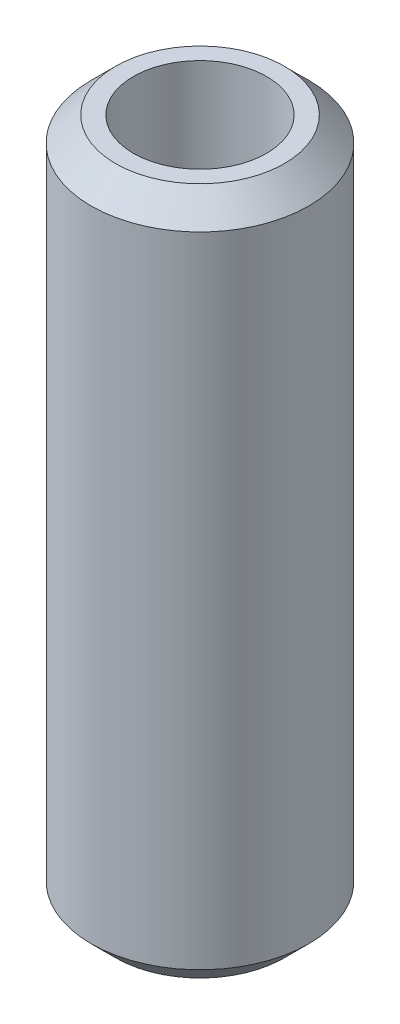
ISO-10303-21;
HEADER;
FILE_DESCRIPTION(('STEP AP214'),'2;1');
FILE_NAME('part.step','',(''),(''),'','','');
FILE_SCHEMA(('AUTOMOTIVE_DESIGN { 1 0 10303 214 1 1 1 1 }'));
ENDSEC;
DATA;
#1=APPLICATION_CONTEXT('core data for automotive mechanical design processes');
#2=APPLICATION_PROTOCOL_DEFINITION('international standard','automotive_design',2000,#1);
#3=PRODUCT_CONTEXT('',#1,'mechanical');
#4=PRODUCT('Part','Part','',(#3));
#5=PRODUCT_RELATED_PRODUCT_CATEGORY('part','',(#4));
#6=PRODUCT_DEFINITION_FORMATION('','',#4);
#7=PRODUCT_DEFINITION_CONTEXT('part definition',#1,'design');
#8=PRODUCT_DEFINITION('design','',#6,#7);
#9=PRODUCT_DEFINITION_SHAPE('','',#8);
#10=(LENGTH_UNIT() NAMED_UNIT(*) SI_UNIT(.MILLI.,.METRE.));
#11=(NAMED_UNIT(*) PLANE_ANGLE_UNIT() SI_UNIT($,.RADIAN.));
#12=(NAMED_UNIT(*) SI_UNIT($,.STERADIAN.) SOLID_ANGLE_UNIT());
#13=UNCERTAINTY_MEASURE_WITH_UNIT(LENGTH_MEASURE(1.E-05),#10,'distance_accuracy_value','');
#14=(GEOMETRIC_REPRESENTATION_CONTEXT(3) GLOBAL_UNCERTAINTY_ASSIGNED_CONTEXT((#13)) GLOBAL_UNIT_ASSIGNED_CONTEXT((#10,
#11,#12)) REPRESENTATION_CONTEXT('',''));
#15=CARTESIAN_POINT('',(0.,0.,0.));
#16=DIRECTION('',(0.,0.,1.));
#17=DIRECTION('',(1.,0.,0.));
#18=AXIS2_PLACEMENT_3D('',#15,#16,#17);
#19=CARTESIAN_POINT('',(0.,47.3929526354359,0.));
#20=DIRECTION('',(0.,-1.,0.));
#21=DIRECTION('',(0.,0.,-1.));
#22=AXIS2_PLACEMENT_3D('',#19,#20,#21);
#23=CYLINDRICAL_SURFACE('',#22,7.5);
#24=CARTESIAN_POINT('',(0.,45.7083332491273,0.));
#25=DIRECTION('',(0.,1.,0.));
#26=DIRECTION('',(0.,0.,1.));
#27=AXIS2_PLACEMENT_3D('',#24,#25,#26);
#28=CIRCLE('',#27,7.5);
#29=CARTESIAN_POINT('',(0.,45.7083332491273,7.5));
#30=VERTEX_POINT('',#29);
#31=EDGE_CURVE('E50',#30,#30,#28,.F.);
#32=ORIENTED_EDGE('',*,*,#31,.T.);
#33=EDGE_LOOP('',(#32));
#34=FACE_BOUND('',#33,.T.);
#35=CARTESIAN_POINT('',(0.,1.68461938630858,0.));
#36=DIRECTION('',(0.,1.,0.));
#37=DIRECTION('',(0.,0.,1.));
#38=AXIS2_PLACEMENT_3D('',#35,#36,#37);
#39=CIRCLE('',#38,7.5);
#40=CARTESIAN_POINT('',(0.,1.68461938630858,7.5));
#41=VERTEX_POINT('',#40);
#42=EDGE_CURVE('E51',#41,#41,#39,.T.);
#43=ORIENTED_EDGE('',*,*,#42,.T.);
#44=EDGE_LOOP('',(#43));
#45=FACE_BOUND('',#44,.T.);
#46=ADVANCED_FACE('F39',(#34,#45),#23,.T.);
#47=CARTESIAN_POINT('',(0.,47.3929526354359,0.));
#48=DIRECTION('',(0.,1.,0.));
#49=DIRECTION('',(0.,0.,1.));
#50=AXIS2_PLACEMENT_3D('',#47,#48,#49);
#51=PLANE('',#50);
#52=CARTESIAN_POINT('',(0.,47.3929526354359,0.));
#53=DIRECTION('',(0.,1.,0.));
#54=DIRECTION('',(0.,0.,1.));
#55=AXIS2_PLACEMENT_3D('',#52,#53,#54);
#56=CIRCLE('',#55,5.81538061369141);
#57=CARTESIAN_POINT('',(0.,47.3929526354359,5.81538061369141));
#58=VERTEX_POINT('',#57);
#59=EDGE_CURVE('E54',#58,#58,#56,.T.);
#60=ORIENTED_EDGE('',*,*,#59,.T.);
#61=EDGE_LOOP('',(#60));
#62=FACE_BOUND('',#61,.T.);
#63=CARTESIAN_POINT('',(0.,47.3929526354359,0.));
#64=DIRECTION('',(0.,1.,0.));
#65=DIRECTION('',(0.,0.,1.));
#66=AXIS2_PLACEMENT_3D('',#63,#64,#65);
#67=CIRCLE('',#66,4.58861318482723);
#68=CARTESIAN_POINT('',(0.,47.3929526354359,4.58861318482723));
#69=VERTEX_POINT('',#68);
#70=EDGE_CURVE('E58',#69,#69,#67,.T.);
#71=ORIENTED_EDGE('',*,*,#70,.F.);
#72=EDGE_LOOP('',(#71));
#73=FACE_BOUND('',#72,.T.);
#74=ADVANCED_FACE('F69',(#62,#73),#51,.T.);
#75=CARTESIAN_POINT('',(0.,0.,0.));
#76=DIRECTION('',(0.,1.,0.));
#77=DIRECTION('',(0.,0.,1.));
#78=AXIS2_PLACEMENT_3D('',#75,#76,#77);
#79=PLANE('',#78);
#80=CARTESIAN_POINT('',(0.,0.,0.));
#81=DIRECTION('',(0.,1.,0.));
#82=DIRECTION('',(0.,0.,1.));
#83=AXIS2_PLACEMENT_3D('',#80,#81,#82);
#84=CIRCLE('',#83,5.81538061369141);
#85=CARTESIAN_POINT('',(0.,0.,5.81538061369141));
#86=VERTEX_POINT('',#85);
#87=EDGE_CURVE('E10',#86,#86,#84,.F.);
#88=ORIENTED_EDGE('',*,*,#87,.T.);
#89=EDGE_LOOP('',(#88));
#90=FACE_BOUND('',#89,.T.);
#91=CARTESIAN_POINT('',(0.,0.,0.));
#92=DIRECTION('',(0.,1.,0.));
#93=DIRECTION('',(0.,0.,1.));
#94=AXIS2_PLACEMENT_3D('',#91,#92,#93);
#95=CIRCLE('',#94,4.58861318482723);
#96=CARTESIAN_POINT('',(0.,0.,4.58861318482723));
#97=VERTEX_POINT('',#96);
#98=EDGE_CURVE('E63',#97,#97,#95,.T.);
#99=ORIENTED_EDGE('',*,*,#98,.T.);
#100=EDGE_LOOP('',(#99));
#101=FACE_BOUND('',#100,.T.);
#102=ADVANCED_FACE('F75',(#90,#101),#79,.F.);
#103=CARTESIAN_POINT('',(0.,47.3929526354359,0.));
#104=DIRECTION('',(0.,-1.,0.));
#105=DIRECTION('',(0.,0.,-1.));
#106=AXIS2_PLACEMENT_3D('',#103,#104,#105);
#107=CYLINDRICAL_SURFACE('',#106,4.58861318482723);
#108=ORIENTED_EDGE('',*,*,#70,.T.);
#109=EDGE_LOOP('',(#108));
#110=FACE_BOUND('',#109,.T.);
#111=ORIENTED_EDGE('',*,*,#98,.F.);
#112=EDGE_LOOP('',(#111));
#113=FACE_BOUND('',#112,.T.);
#114=ADVANCED_FACE('F70',(#110,#113),#107,.F.);
#115=CARTESIAN_POINT('',(0.,47.3929526354359,0.));
#116=DIRECTION('',(0.,-1.,0.));
#117=DIRECTION('',(0.,0.,-1.));
#118=AXIS2_PLACEMENT_3D('',#115,#116,#117);
#119=CONICAL_SURFACE('',#118,5.81538061369141,0.785398163397444);
#120=ORIENTED_EDGE('',*,*,#31,.F.);
#121=EDGE_LOOP('',(#120));
#122=FACE_BOUND('',#121,.T.);
#123=ORIENTED_EDGE('',*,*,#59,.F.);
#124=EDGE_LOOP('',(#123));
#125=FACE_BOUND('',#124,.T.);
#126=ADVANCED_FACE('F81',(#122,#125),#119,.T.);
#127=CARTESIAN_POINT('',(0.,1.68461938630858,0.));
#128=DIRECTION('',(0.,1.,0.));
#129=DIRECTION('',(0.,0.,1.));
#130=AXIS2_PLACEMENT_3D('',#127,#128,#129);
#131=CONICAL_SURFACE('',#130,7.5,0.78539816339745);
#132=CARTESIAN_POINT('',(0.,0.,5.81538061369141));
#133=CARTESIAN_POINT('',(0.,0.0175481186073806,5.83292873229879));
#134=CARTESIAN_POINT('',(0.,0.0350962372147617,5.85047685090617));
#135=CARTESIAN_POINT('',(0.,0.070192474429524,5.88557308812094));
#136=CARTESIAN_POINT('',(0.,0.0877405930369051,5.90312120672832));
#137=CARTESIAN_POINT('',(0.,0.122836830251667,5.93821744394308));
#138=CARTESIAN_POINT('',(0.,0.140384948859048,5.95576556255046));
#139=CARTESIAN_POINT('',(0.,0.17548118607381,5.99086179976522));
#140=CARTESIAN_POINT('',(0.,0.193029304681191,6.0084099183726));
#141=CARTESIAN_POINT('',(0.,0.228125541895953,6.04350615558737));
#142=CARTESIAN_POINT('',(0.,0.245673660503335,6.06105427419475));
#143=CARTESIAN_POINT('',(0.,0.280769897718097,6.09615051140951));
#144=CARTESIAN_POINT('',(0.,0.298318016325478,6.11369863001689));
#145=CARTESIAN_POINT('',(0.,0.33341425354024,6.14879486723165));
#146=CARTESIAN_POINT('',(0.,0.350962372147621,6.16634298583903));
#147=CARTESIAN_POINT('',(0.,0.386058609362383,6.2014392230538));
#148=CARTESIAN_POINT('',(0.,0.403606727969764,6.21898734166118));
#149=CARTESIAN_POINT('',(0.,0.438702965184526,6.25408357887594));
#150=CARTESIAN_POINT('',(0.,0.456251083791907,6.27163169748332));
#151=CARTESIAN_POINT('',(0.,0.491347321006669,6.30672793469808));
#152=CARTESIAN_POINT('',(0.,0.50889543961405,6.32427605330546));
#153=CARTESIAN_POINT('',(0.,0.543991676828812,6.35937229052023));
#154=CARTESIAN_POINT('',(0.,0.561539795436193,6.37692040912761));
#155=CARTESIAN_POINT('',(0.,0.596636032650955,6.41201664634237));
#156=CARTESIAN_POINT('',(0.,0.614184151258336,6.42956476494975));
#157=CARTESIAN_POINT('',(0.,0.649280388473099,6.46466100216451));
#158=CARTESIAN_POINT('',(0.,0.66682850708048,6.48220912077189));
#159=CARTESIAN_POINT('',(0.,0.701924744295242,6.51730535798666));
#160=CARTESIAN_POINT('',(0.,0.719472862902623,6.53485347659404));
#161=CARTESIAN_POINT('',(0.,0.754569100117385,6.5699497138088));
#162=CARTESIAN_POINT('',(0.,0.772117218724766,6.58749783241618));
#163=CARTESIAN_POINT('',(0.,0.807213455939528,6.62259406963094));
#164=CARTESIAN_POINT('',(0.,0.824761574546909,6.64014218823833));
#165=CARTESIAN_POINT('',(0.,0.859857811761671,6.67523842545309));
#166=CARTESIAN_POINT('',(0.,0.877405930369052,6.69278654406047));
#167=CARTESIAN_POINT('',(0.,0.912502167583814,6.72788278127523));
#168=CARTESIAN_POINT('',(0.,0.930050286191195,6.74543089988261));
#169=CARTESIAN_POINT('',(0.,0.965146523405958,6.78052713709737));
#170=CARTESIAN_POINT('',(0.,0.982694642013339,6.79807525570476));
#171=CARTESIAN_POINT('',(0.,1.0177908792281,6.83317149291952));
#172=CARTESIAN_POINT('',(0.,1.03533899783548,6.8507196115269));
#173=CARTESIAN_POINT('',(0.,1.07043523505024,6.88581584874166));
#174=CARTESIAN_POINT('',(0.,1.08798335365762,6.90336396734904));
#175=CARTESIAN_POINT('',(0.,1.12307959087239,6.9384602045638));
#176=CARTESIAN_POINT('',(0.,1.14062770947977,6.95600832317118));
#177=CARTESIAN_POINT('',(0.,1.17572394669453,6.99110456038595));
#178=CARTESIAN_POINT('',(0.,1.19327206530191,7.00865267899333));
#179=CARTESIAN_POINT('',(0.,1.22836830251667,7.04374891620809));
#180=CARTESIAN_POINT('',(0.,1.24591642112405,7.06129703481547));
#181=CARTESIAN_POINT('',(0.,1.28101265833882,7.09639327203023));
#182=CARTESIAN_POINT('',(0.,1.2985607769462,7.11394139063762));
#183=CARTESIAN_POINT('',(0.,1.33365701416096,7.14903762785238));
#184=CARTESIAN_POINT('',(0.,1.35120513276834,7.16658574645976));
#185=CARTESIAN_POINT('',(0.,1.3863013699831,7.20168198367452));
#186=CARTESIAN_POINT('',(0.,1.40384948859048,7.2192301022819));
#187=CARTESIAN_POINT('',(0.,1.43894572580525,7.25432633949666));
#188=CARTESIAN_POINT('',(0.,1.45649384441263,7.27187445810405));
#189=CARTESIAN_POINT('',(0.,1.49159008162739,7.30697069531881));
#190=CARTESIAN_POINT('',(0.,1.50913820023477,7.32451881392619));
#191=CARTESIAN_POINT('',(0.,1.54423443744953,7.35961505114095));
#192=CARTESIAN_POINT('',(0.,1.56178255605691,7.37716316974833));
#193=CARTESIAN_POINT('',(0.,1.59687879327168,7.41225940696309));
#194=CARTESIAN_POINT('',(0.,1.61442691187906,7.42980752557048));
#195=CARTESIAN_POINT('',(0.,1.64952314909382,7.46490376278524));
#196=CARTESIAN_POINT('',(0.,1.6670712677012,7.48245188139262));
#197=CARTESIAN_POINT('',(0.,1.68461938630858,7.5));
#198=B_SPLINE_CURVE_WITH_KNOTS('',3,(#132,#133,#134,#135,#136,#137,#138,#139,#140,#141,#142,
#143,#144,#145,#146,#147,#148,#149,#150,#151,#152,#153,#154,#155,#156,#157,#158,#159,#160,#161,
#162,#163,#164,#165,#166,#167,#168,#169,#170,#171,#172,#173,#174,#175,#176,#177,#178,#179,#180,
#181,#182,#183,#184,#185,#186,#187,#188,#189,#190,#191,#192,#193,#194,#195,#196,#197),
.UNSPECIFIED.,.F.,.F.,(4,2,2,2,2,2,2,2,2,2,2,2,2,2,2,2,2,2,2,2,2,2,2,2,2,2,2,2,2,2,2,2,4),(0.,
0.0744503619860701,0.14890072397214,0.22335108595821,0.29780144794428,0.37225180993035,
0.44670217191642,0.52115253390249,0.59560289588856,0.67005325787463,0.7445036198607,
0.81895398184677,0.89340434383284,0.967854705818909,1.04230506780498,1.11675542979105,
1.19120579177712,1.26565615376319,1.34010651574926,1.41455687773533,1.4890072397214,
1.56345760170747,1.63790796369354,1.71235832567961,1.78680868766568,1.86125904965175,
1.93570941163782,2.01015977362389,2.08461013560996,2.15906049759603,2.2335108595821,
2.30796122156817,2.38241158355424),.UNSPECIFIED.);
#199=EDGE_CURVE('BSEAM45',#86,#41,#198,.T.);
#200=ORIENTED_EDGE('',*,*,#87,.F.);
#201=ORIENTED_EDGE('',*,*,#42,.F.);
#202=ORIENTED_EDGE('',*,*,#199,.T.);
#203=ORIENTED_EDGE('',*,*,#199,.F.);
#204=EDGE_LOOP('',(#200,#202,#201,#203));
#205=FACE_BOUND('',#204,.T.);
#206=ADVANCED_FACE('F45',(#205),#131,.T.);
#207=CLOSED_SHELL('',(#46,#74,#102,#114,#126,#206));
#208=MANIFOLD_SOLID_BREP('B2',#207);
#209=ADVANCED_BREP_SHAPE_REPRESENTATION('',(#18,#208),#14);
#210=SHAPE_DEFINITION_REPRESENTATION(#9,#209);
ENDSEC;
END-ISO-10303-21;
